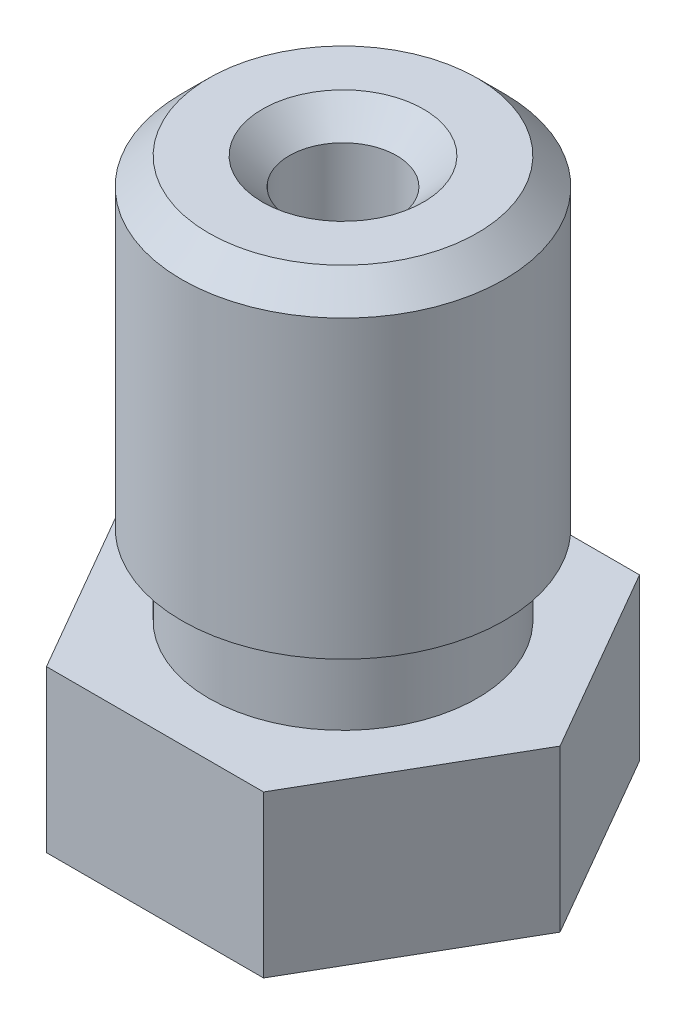
ISO-10303-21;
HEADER;
FILE_DESCRIPTION(('STEP AP214'),'2;1');
FILE_NAME('part.step','',(''),(''),'','','');
FILE_SCHEMA(('AUTOMOTIVE_DESIGN { 1 0 10303 214 1 1 1 1 }'));
ENDSEC;
DATA;
#1=APPLICATION_CONTEXT('core data for automotive mechanical design processes');
#2=APPLICATION_PROTOCOL_DEFINITION('international standard','automotive_design',2000,#1);
#3=PRODUCT_CONTEXT('',#1,'mechanical');
#4=PRODUCT('Part','Part','',(#3));
#5=PRODUCT_RELATED_PRODUCT_CATEGORY('part','',(#4));
#6=PRODUCT_DEFINITION_FORMATION('','',#4);
#7=PRODUCT_DEFINITION_CONTEXT('part definition',#1,'design');
#8=PRODUCT_DEFINITION('design','',#6,#7);
#9=PRODUCT_DEFINITION_SHAPE('','',#8);
#10=(LENGTH_UNIT() NAMED_UNIT(*) SI_UNIT(.MILLI.,.METRE.));
#11=(NAMED_UNIT(*) PLANE_ANGLE_UNIT() SI_UNIT($,.RADIAN.));
#12=(NAMED_UNIT(*) SI_UNIT($,.STERADIAN.) SOLID_ANGLE_UNIT());
#13=UNCERTAINTY_MEASURE_WITH_UNIT(LENGTH_MEASURE(1.E-05),#10,'distance_accuracy_value','');
#14=(GEOMETRIC_REPRESENTATION_CONTEXT(3) GLOBAL_UNCERTAINTY_ASSIGNED_CONTEXT((#13)) GLOBAL_UNIT_ASSIGNED_CONTEXT((#10,
#11,#12)) REPRESENTATION_CONTEXT('',''));
#15=CARTESIAN_POINT('',(0.,0.,0.));
#16=DIRECTION('',(0.,0.,1.));
#17=DIRECTION('',(1.,0.,0.));
#18=AXIS2_PLACEMENT_3D('',#15,#16,#17);
#19=CARTESIAN_POINT('',(2.02072594216369,3.,3.5));
#20=DIRECTION('',(0.,0.,1.));
#21=DIRECTION('',(1.,0.,0.));
#22=AXIS2_PLACEMENT_3D('',#19,#20,#21);
#23=PLANE('',#22);
#24=DIRECTION('',(-1.,0.,0.));
#25=VECTOR('',#24,1.);
#26=CARTESIAN_POINT('',(2.02072594216369,0.,3.5));
#27=LINE('',#26,#25);
#28=CARTESIAN_POINT('',(2.02072594216369,0.,3.5));
#29=VERTEX_POINT('',#28);
#30=CARTESIAN_POINT('',(-2.02072594216369,0.,3.5));
#31=VERTEX_POINT('',#30);
#32=EDGE_CURVE('E121',#29,#31,#27,.T.);
#33=ORIENTED_EDGE('',*,*,#32,.F.);
#34=DIRECTION('',(0.,-1.,0.));
#35=VECTOR('',#34,1.);
#36=CARTESIAN_POINT('',(2.02072594216369,3.,3.5));
#37=LINE('',#36,#35);
#38=CARTESIAN_POINT('',(2.02072594216369,3.,3.5));
#39=VERTEX_POINT('',#38);
#40=EDGE_CURVE('E50',#39,#29,#37,.T.);
#41=ORIENTED_EDGE('',*,*,#40,.F.);
#42=DIRECTION('',(-1.,0.,0.));
#43=VECTOR('',#42,1.);
#44=CARTESIAN_POINT('',(2.02072594216369,3.,3.5));
#45=LINE('',#44,#43);
#46=CARTESIAN_POINT('',(-2.02072594216369,3.,3.5));
#47=VERTEX_POINT('',#46);
#48=EDGE_CURVE('E137',#39,#47,#45,.T.);
#49=ORIENTED_EDGE('',*,*,#48,.T.);
#50=DIRECTION('',(0.,-1.,0.));
#51=VECTOR('',#50,1.);
#52=CARTESIAN_POINT('',(-2.02072594216369,3.,3.5));
#53=LINE('',#52,#51);
#54=EDGE_CURVE('E85',#47,#31,#53,.T.);
#55=ORIENTED_EDGE('',*,*,#54,.T.);
#56=EDGE_LOOP('',(#33,#41,#49,#55));
#57=FACE_BOUND('',#56,.T.);
#58=ADVANCED_FACE('F33',(#57),#23,.T.);
#59=CARTESIAN_POINT('',(4.04145188432738,3.,0.));
#60=DIRECTION('',(0.866025403784439,0.,0.5));
#61=DIRECTION('',(0.5,0.,-0.866025403784439));
#62=AXIS2_PLACEMENT_3D('',#59,#60,#61);
#63=PLANE('',#62);
#64=DIRECTION('',(-0.5,0.,0.866025403784439));
#65=VECTOR('',#64,1.);
#66=CARTESIAN_POINT('',(4.04145188432738,0.,0.));
#67=LINE('',#66,#65);
#68=CARTESIAN_POINT('',(4.04145188432738,0.,0.));
#69=VERTEX_POINT('',#68);
#70=EDGE_CURVE('E134',#69,#29,#67,.T.);
#71=ORIENTED_EDGE('',*,*,#70,.F.);
#72=DIRECTION('',(0.,-1.,0.));
#73=VECTOR('',#72,1.);
#74=CARTESIAN_POINT('',(4.04145188432738,3.,0.));
#75=LINE('',#74,#73);
#76=CARTESIAN_POINT('',(4.04145188432738,3.,0.));
#77=VERTEX_POINT('',#76);
#78=EDGE_CURVE('E73',#77,#69,#75,.T.);
#79=ORIENTED_EDGE('',*,*,#78,.F.);
#80=DIRECTION('',(-0.5,0.,0.866025403784439));
#81=VECTOR('',#80,1.);
#82=CARTESIAN_POINT('',(4.04145188432738,3.,0.));
#83=LINE('',#82,#81);
#84=EDGE_CURVE('E111',#77,#39,#83,.T.);
#85=ORIENTED_EDGE('',*,*,#84,.T.);
#86=ORIENTED_EDGE('',*,*,#40,.T.);
#87=EDGE_LOOP('',(#71,#79,#85,#86));
#88=FACE_BOUND('',#87,.T.);
#89=ADVANCED_FACE('F210',(#88),#63,.T.);
#90=CARTESIAN_POINT('',(2.02072594216369,3.,-3.5));
#91=DIRECTION('',(0.866025403784438,0.,-0.500000000000001));
#92=DIRECTION('',(-0.500000000000001,0.,-0.866025403784438));
#93=AXIS2_PLACEMENT_3D('',#90,#91,#92);
#94=PLANE('',#93);
#95=DIRECTION('',(0.500000000000001,0.,0.866025403784438));
#96=VECTOR('',#95,1.);
#97=CARTESIAN_POINT('',(2.02072594216369,0.,-3.5));
#98=LINE('',#97,#96);
#99=CARTESIAN_POINT('',(2.02072594216369,0.,-3.5));
#100=VERTEX_POINT('',#99);
#101=EDGE_CURVE('E98',#100,#69,#98,.T.);
#102=ORIENTED_EDGE('',*,*,#101,.F.);
#103=DIRECTION('',(0.,-1.,0.));
#104=VECTOR('',#103,1.);
#105=CARTESIAN_POINT('',(2.02072594216369,3.,-3.5));
#106=LINE('',#105,#104);
#107=CARTESIAN_POINT('',(2.02072594216369,3.,-3.5));
#108=VERTEX_POINT('',#107);
#109=EDGE_CURVE('E93',#108,#100,#106,.T.);
#110=ORIENTED_EDGE('',*,*,#109,.F.);
#111=DIRECTION('',(0.500000000000001,0.,0.866025403784438));
#112=VECTOR('',#111,1.);
#113=CARTESIAN_POINT('',(2.02072594216369,3.,-3.5));
#114=LINE('',#113,#112);
#115=EDGE_CURVE('E96',#108,#77,#114,.T.);
#116=ORIENTED_EDGE('',*,*,#115,.T.);
#117=ORIENTED_EDGE('',*,*,#78,.T.);
#118=EDGE_LOOP('',(#102,#110,#116,#117));
#119=FACE_BOUND('',#118,.T.);
#120=ADVANCED_FACE('F95',(#119),#94,.T.);
#121=CARTESIAN_POINT('',(-2.02072594216369,3.,-3.5));
#122=DIRECTION('',(0.,0.,-1.));
#123=DIRECTION('',(-1.,0.,0.));
#124=AXIS2_PLACEMENT_3D('',#121,#122,#123);
#125=PLANE('',#124);
#126=DIRECTION('',(1.,0.,0.));
#127=VECTOR('',#126,1.);
#128=CARTESIAN_POINT('',(-2.02072594216369,0.,-3.5));
#129=LINE('',#128,#127);
#130=CARTESIAN_POINT('',(-2.02072594216369,0.,-3.5));
#131=VERTEX_POINT('',#130);
#132=EDGE_CURVE('E131',#131,#100,#129,.T.);
#133=ORIENTED_EDGE('',*,*,#132,.F.);
#134=DIRECTION('',(0.,-1.,0.));
#135=VECTOR('',#134,1.);
#136=CARTESIAN_POINT('',(-2.02072594216369,3.,-3.5));
#137=LINE('',#136,#135);
#138=CARTESIAN_POINT('',(-2.02072594216369,3.,-3.5));
#139=VERTEX_POINT('',#138);
#140=EDGE_CURVE('E103',#139,#131,#137,.T.);
#141=ORIENTED_EDGE('',*,*,#140,.F.);
#142=DIRECTION('',(1.,0.,0.));
#143=VECTOR('',#142,1.);
#144=CARTESIAN_POINT('',(-2.02072594216369,3.,-3.5));
#145=LINE('',#144,#143);
#146=EDGE_CURVE('E109',#139,#108,#145,.T.);
#147=ORIENTED_EDGE('',*,*,#146,.T.);
#148=ORIENTED_EDGE('',*,*,#109,.T.);
#149=EDGE_LOOP('',(#133,#141,#147,#148));
#150=FACE_BOUND('',#149,.T.);
#151=ADVANCED_FACE('F113',(#150),#125,.T.);
#152=CARTESIAN_POINT('',(-4.04145188432738,3.,0.));
#153=DIRECTION('',(-0.866025403784439,0.,-0.5));
#154=DIRECTION('',(-0.5,0.,0.866025403784439));
#155=AXIS2_PLACEMENT_3D('',#152,#153,#154);
#156=PLANE('',#155);
#157=DIRECTION('',(0.5,0.,-0.866025403784439));
#158=VECTOR('',#157,1.);
#159=CARTESIAN_POINT('',(-4.04145188432738,0.,0.));
#160=LINE('',#159,#158);
#161=CARTESIAN_POINT('',(-4.04145188432738,0.,0.));
#162=VERTEX_POINT('',#161);
#163=EDGE_CURVE('E128',#162,#131,#160,.T.);
#164=ORIENTED_EDGE('',*,*,#163,.F.);
#165=DIRECTION('',(0.,-1.,0.));
#166=VECTOR('',#165,1.);
#167=CARTESIAN_POINT('',(-4.04145188432738,3.,0.));
#168=LINE('',#167,#166);
#169=CARTESIAN_POINT('',(-4.04145188432738,3.,0.));
#170=VERTEX_POINT('',#169);
#171=EDGE_CURVE('E142',#170,#162,#168,.T.);
#172=ORIENTED_EDGE('',*,*,#171,.F.);
#173=DIRECTION('',(0.5,0.,-0.866025403784439));
#174=VECTOR('',#173,1.);
#175=CARTESIAN_POINT('',(-4.04145188432738,3.,0.));
#176=LINE('',#175,#174);
#177=EDGE_CURVE('E114',#170,#139,#176,.T.);
#178=ORIENTED_EDGE('',*,*,#177,.T.);
#179=ORIENTED_EDGE('',*,*,#140,.T.);
#180=EDGE_LOOP('',(#164,#172,#178,#179));
#181=FACE_BOUND('',#180,.T.);
#182=ADVANCED_FACE('F224',(#181),#156,.T.);
#183=CARTESIAN_POINT('',(-2.02072594216369,3.,3.5));
#184=DIRECTION('',(-0.866025403784439,0.,0.5));
#185=DIRECTION('',(0.5,0.,0.866025403784439));
#186=AXIS2_PLACEMENT_3D('',#183,#184,#185);
#187=PLANE('',#186);
#188=DIRECTION('',(-0.5,0.,-0.866025403784439));
#189=VECTOR('',#188,1.);
#190=CARTESIAN_POINT('',(-2.02072594216369,0.,3.5));
#191=LINE('',#190,#189);
#192=EDGE_CURVE('E124',#31,#162,#191,.T.);
#193=ORIENTED_EDGE('',*,*,#192,.F.);
#194=ORIENTED_EDGE('',*,*,#54,.F.);
#195=DIRECTION('',(-0.5,0.,-0.866025403784439));
#196=VECTOR('',#195,1.);
#197=CARTESIAN_POINT('',(-2.02072594216369,3.,3.5));
#198=LINE('',#197,#196);
#199=EDGE_CURVE('E116',#47,#170,#198,.T.);
#200=ORIENTED_EDGE('',*,*,#199,.T.);
#201=ORIENTED_EDGE('',*,*,#171,.T.);
#202=EDGE_LOOP('',(#193,#194,#200,#201));
#203=FACE_BOUND('',#202,.T.);
#204=ADVANCED_FACE('F206',(#203),#187,.T.);
#205=CARTESIAN_POINT('',(0.,3.,0.));
#206=DIRECTION('',(0.,-1.,0.));
#207=DIRECTION('',(0.,0.,-1.));
#208=AXIS2_PLACEMENT_3D('',#205,#206,#207);
#209=PLANE('',#208);
#210=CARTESIAN_POINT('',(0.,3.,0.));
#211=DIRECTION('',(0.,1.,0.));
#212=DIRECTION('',(0.,0.,1.));
#213=AXIS2_PLACEMENT_3D('',#210,#211,#212);
#214=CIRCLE('',#213,2.5);
#215=CARTESIAN_POINT('',(0.,3.,2.5));
#216=VERTEX_POINT('',#215);
#217=EDGE_CURVE('E125',#216,#216,#214,.T.);
#218=ORIENTED_EDGE('',*,*,#217,.F.);
#219=EDGE_LOOP('',(#218));
#220=FACE_BOUND('',#219,.T.);
#221=ORIENTED_EDGE('',*,*,#48,.F.);
#222=ORIENTED_EDGE('',*,*,#84,.F.);
#223=ORIENTED_EDGE('',*,*,#115,.F.);
#224=ORIENTED_EDGE('',*,*,#146,.F.);
#225=ORIENTED_EDGE('',*,*,#177,.F.);
#226=ORIENTED_EDGE('',*,*,#199,.F.);
#227=EDGE_LOOP('',(#221,#222,#223,#224,#225,#226));
#228=FACE_BOUND('',#227,.T.);
#229=ADVANCED_FACE('F107',(#220,#228),#209,.F.);
#230=CARTESIAN_POINT('',(0.,0.,0.));
#231=DIRECTION('',(0.,-1.,0.));
#232=DIRECTION('',(0.,0.,-1.));
#233=AXIS2_PLACEMENT_3D('',#230,#231,#232);
#234=PLANE('',#233);
#235=CARTESIAN_POINT('',(0.,0.,0.));
#236=DIRECTION('',(0.,-1.,0.));
#237=DIRECTION('',(0.,0.,-1.));
#238=AXIS2_PLACEMENT_3D('',#235,#236,#237);
#239=CIRCLE('',#238,2.50000000004502);
#240=CARTESIAN_POINT('',(0.,0.,-2.50000000004502));
#241=VERTEX_POINT('',#240);
#242=EDGE_CURVE('E139',#241,#241,#239,.T.);
#243=ORIENTED_EDGE('',*,*,#242,.F.);
#244=EDGE_LOOP('',(#243));
#245=FACE_BOUND('',#244,.T.);
#246=ORIENTED_EDGE('',*,*,#32,.T.);
#247=ORIENTED_EDGE('',*,*,#192,.T.);
#248=ORIENTED_EDGE('',*,*,#163,.T.);
#249=ORIENTED_EDGE('',*,*,#132,.T.);
#250=ORIENTED_EDGE('',*,*,#101,.T.);
#251=ORIENTED_EDGE('',*,*,#70,.T.);
#252=EDGE_LOOP('',(#246,#247,#248,#249,#250,#251));
#253=FACE_BOUND('',#252,.T.);
#254=ADVANCED_FACE('F209',(#245,#253),#234,.T.);
#255=CARTESIAN_POINT('',(0.,3.,0.));
#256=DIRECTION('',(0.,1.,0.));
#257=DIRECTION('',(0.,0.,1.));
#258=AXIS2_PLACEMENT_3D('',#255,#256,#257);
#259=CYLINDRICAL_SURFACE('',#258,2.5);
#260=ORIENTED_EDGE('',*,*,#217,.T.);
#261=EDGE_LOOP('',(#260));
#262=FACE_BOUND('',#261,.T.);
#263=CARTESIAN_POINT('',(0.,4.5,0.));
#264=DIRECTION('',(0.,1.,0.));
#265=DIRECTION('',(0.,0.,1.));
#266=AXIS2_PLACEMENT_3D('',#263,#264,#265);
#267=CIRCLE('',#266,2.5);
#268=CARTESIAN_POINT('',(0.,4.5,2.5));
#269=VERTEX_POINT('',#268);
#270=EDGE_CURVE('E198',#269,#269,#267,.T.);
#271=ORIENTED_EDGE('',*,*,#270,.F.);
#272=EDGE_LOOP('',(#271));
#273=FACE_BOUND('',#272,.T.);
#274=ADVANCED_FACE('F167',(#262,#273),#259,.T.);
#275=CARTESIAN_POINT('',(0.,10.5,0.));
#276=DIRECTION('',(0.,1.,0.));
#277=DIRECTION('',(0.,0.,1.));
#278=AXIS2_PLACEMENT_3D('',#275,#276,#277);
#279=PLANE('',#278);
#280=CARTESIAN_POINT('',(0.,10.5,0.));
#281=DIRECTION('',(0.,1.,0.));
#282=DIRECTION('',(0.,0.,1.));
#283=AXIS2_PLACEMENT_3D('',#280,#281,#282);
#284=CIRCLE('',#283,2.4999999999834);
#285=CARTESIAN_POINT('',(0.,10.5,2.4999999999834));
#286=VERTEX_POINT('',#285);
#287=EDGE_CURVE('E150',#286,#286,#284,.T.);
#288=ORIENTED_EDGE('',*,*,#287,.T.);
#289=EDGE_LOOP('',(#288));
#290=FACE_BOUND('',#289,.T.);
#291=CARTESIAN_POINT('',(-1.10963134903613E-11,10.5,0.));
#292=DIRECTION('',(0.,1.,0.));
#293=DIRECTION('',(0.,0.,1.));
#294=AXIS2_PLACEMENT_3D('',#291,#292,#293);
#295=CIRCLE('',#294,1.5000000000277);
#296=CARTESIAN_POINT('',(-1.10963134903613E-11,10.5,1.5000000000277));
#297=VERTEX_POINT('',#296);
#298=EDGE_CURVE('E147',#297,#297,#295,.F.);
#299=ORIENTED_EDGE('',*,*,#298,.T.);
#300=EDGE_LOOP('',(#299));
#301=FACE_BOUND('',#300,.T.);
#302=ADVANCED_FACE('F164',(#290,#301),#279,.T.);
#303=CARTESIAN_POINT('',(0.,3.,0.));
#304=DIRECTION('',(0.,1.,0.));
#305=DIRECTION('',(0.,0.,1.));
#306=AXIS2_PLACEMENT_3D('',#303,#304,#305);
#307=CYLINDRICAL_SURFACE('',#306,3.);
#308=CARTESIAN_POINT('',(0.,9.9999999999834,0.));
#309=DIRECTION('',(0.,1.,0.));
#310=DIRECTION('',(0.,0.,1.));
#311=AXIS2_PLACEMENT_3D('',#308,#309,#310);
#312=CIRCLE('',#311,3.);
#313=CARTESIAN_POINT('',(0.,9.9999999999834,3.));
#314=VERTEX_POINT('',#313);
#315=EDGE_CURVE('E42',#314,#314,#312,.F.);
#316=ORIENTED_EDGE('',*,*,#315,.T.);
#317=EDGE_LOOP('',(#316));
#318=FACE_BOUND('',#317,.T.);
#319=CARTESIAN_POINT('',(0.,4.5,0.));
#320=DIRECTION('',(0.,1.,0.));
#321=DIRECTION('',(0.,0.,1.));
#322=AXIS2_PLACEMENT_3D('',#319,#320,#321);
#323=CIRCLE('',#322,3.);
#324=CARTESIAN_POINT('',(0.,4.5,3.));
#325=VERTEX_POINT('',#324);
#326=EDGE_CURVE('E201',#325,#325,#323,.T.);
#327=ORIENTED_EDGE('',*,*,#326,.T.);
#328=EDGE_LOOP('',(#327));
#329=FACE_BOUND('',#328,.T.);
#330=ADVANCED_FACE('F155',(#318,#329),#307,.T.);
#331=CARTESIAN_POINT('',(3.,4.5,0.));
#332=DIRECTION('',(0.,-1.,0.));
#333=DIRECTION('',(0.,0.,-1.));
#334=AXIS2_PLACEMENT_3D('',#331,#332,#333);
#335=PLANE('',#334);
#336=ORIENTED_EDGE('',*,*,#270,.T.);
#337=EDGE_LOOP('',(#336));
#338=FACE_BOUND('',#337,.T.);
#339=ORIENTED_EDGE('',*,*,#326,.F.);
#340=EDGE_LOOP('',(#339));
#341=FACE_BOUND('',#340,.T.);
#342=ADVANCED_FACE('F244',(#338,#341),#335,.T.);
#343=CARTESIAN_POINT('',(0.,-2.,0.));
#344=DIRECTION('',(0.,1.,0.));
#345=DIRECTION('',(-1.,0.,0.));
#346=AXIS2_PLACEMENT_3D('',#343,#344,#345);
#347=CONICAL_SURFACE('',#346,0.50000000004502,0.785398163397449);
#348=ORIENTED_EDGE('',*,*,#242,.T.);
#349=EDGE_LOOP('',(#348));
#350=FACE_BOUND('',#349,.T.);
#351=CARTESIAN_POINT('',(0.,-2.,0.));
#352=DIRECTION('',(0.,-1.,0.));
#353=DIRECTION('',(1.,0.,0.));
#354=AXIS2_PLACEMENT_3D('',#351,#352,#353);
#355=CIRCLE('',#354,0.50000000004502);
#356=CARTESIAN_POINT('',(0.50000000004502,-2.,0.));
#357=VERTEX_POINT('',#356);
#358=EDGE_CURVE('E189',#357,#357,#355,.T.);
#359=ORIENTED_EDGE('',*,*,#358,.F.);
#360=EDGE_LOOP('',(#359));
#361=FACE_BOUND('',#360,.T.);
#362=ADVANCED_FACE('F247',(#350,#361),#347,.T.);
#363=CARTESIAN_POINT('',(0.,-2.,0.));
#364=DIRECTION('',(0.,-1.,0.));
#365=DIRECTION('',(1.,0.,0.));
#366=AXIS2_PLACEMENT_3D('',#363,#364,#365);
#367=PLANE('',#366);
#368=CARTESIAN_POINT('',(-1.10963134903613E-11,-2.,0.));
#369=DIRECTION('',(0.,1.,0.));
#370=DIRECTION('',(0.,0.,1.));
#371=AXIS2_PLACEMENT_3D('',#368,#369,#370);
#372=CIRCLE('',#371,0.15);
#373=CARTESIAN_POINT('',(-1.10963134903613E-11,-2.,0.15));
#374=VERTEX_POINT('',#373);
#375=EDGE_CURVE('E185',#374,#374,#372,.T.);
#376=ORIENTED_EDGE('',*,*,#375,.T.);
#377=EDGE_LOOP('',(#376));
#378=FACE_BOUND('',#377,.T.);
#379=ORIENTED_EDGE('',*,*,#358,.T.);
#380=EDGE_LOOP('',(#379));
#381=FACE_BOUND('',#380,.T.);
#382=ADVANCED_FACE('F251',(#378,#381),#367,.T.);
#383=CARTESIAN_POINT('',(-1.10963134903613E-11,-2.,0.));
#384=DIRECTION('',(0.,1.,0.));
#385=DIRECTION('',(0.,0.,1.));
#386=AXIS2_PLACEMENT_3D('',#383,#384,#385);
#387=CYLINDRICAL_SURFACE('',#386,0.15);
#388=ORIENTED_EDGE('',*,*,#375,.F.);
#389=EDGE_LOOP('',(#388));
#390=FACE_BOUND('',#389,.T.);
#391=CARTESIAN_POINT('',(-1.10963134903613E-11,-1.20000000003984,0.));
#392=DIRECTION('',(0.,1.,0.));
#393=DIRECTION('',(0.,0.,1.));
#394=AXIS2_PLACEMENT_3D('',#391,#392,#393);
#395=CIRCLE('',#394,0.15);
#396=CARTESIAN_POINT('',(-1.10963134903613E-11,-1.20000000003984,0.15));
#397=VERTEX_POINT('',#396);
#398=EDGE_CURVE('E273',#397,#397,#395,.T.);
#399=ORIENTED_EDGE('',*,*,#398,.T.);
#400=EDGE_LOOP('',(#399));
#401=FACE_BOUND('',#400,.T.);
#402=ADVANCED_FACE('F179',(#390,#401),#387,.F.);
#403=CARTESIAN_POINT('',(-1.10963134903613E-11,-2.,0.));
#404=DIRECTION('',(0.,1.,0.));
#405=DIRECTION('',(0.,0.,1.));
#406=AXIS2_PLACEMENT_3D('',#403,#404,#405);
#407=CYLINDRICAL_SURFACE('',#406,1.0000000000111);
#408=CARTESIAN_POINT('',(-1.10963134903613E-11,9.9999999999834,0.));
#409=DIRECTION('',(0.,1.,0.));
#410=DIRECTION('',(0.,0.,1.));
#411=AXIS2_PLACEMENT_3D('',#408,#409,#410);
#412=CIRCLE('',#411,1.0000000000111);
#413=CARTESIAN_POINT('',(-1.10963134903613E-11,9.9999999999834,1.0000000000111));
#414=VERTEX_POINT('',#413);
#415=EDGE_CURVE('E11',#414,#414,#412,.T.);
#416=ORIENTED_EDGE('',*,*,#415,.T.);
#417=EDGE_LOOP('',(#416));
#418=FACE_BOUND('',#417,.T.);
#419=CARTESIAN_POINT('',(-1.10963134903613E-11,0.,0.));
#420=DIRECTION('',(0.,1.,0.));
#421=DIRECTION('',(0.,0.,1.));
#422=AXIS2_PLACEMENT_3D('',#419,#420,#421);
#423=CIRCLE('',#422,1.0000000000111);
#424=CARTESIAN_POINT('',(-1.10963134903613E-11,0.,1.0000000000111));
#425=VERTEX_POINT('',#424);
#426=EDGE_CURVE('E183',#425,#425,#423,.T.);
#427=ORIENTED_EDGE('',*,*,#426,.F.);
#428=EDGE_LOOP('',(#427));
#429=FACE_BOUND('',#428,.T.);
#430=ADVANCED_FACE('F175',(#418,#429),#407,.F.);
#431=CARTESIAN_POINT('',(-1.10963134903613E-11,0.,0.));
#432=DIRECTION('',(0.,1.,0.));
#433=DIRECTION('',(0.,0.,1.));
#434=AXIS2_PLACEMENT_3D('',#431,#432,#433);
#435=CONICAL_SURFACE('',#434,1.0000000000111,0.832981266710198);
#436=CARTESIAN_POINT('',(-1.10963134903613E-11,-0.227272727272521,0.));
#437=DIRECTION('',(0.,1.,0.));
#438=DIRECTION('',(0.,0.,1.));
#439=AXIS2_PLACEMENT_3D('',#436,#437,#438);
#440=CIRCLE('',#439,0.749999999993361);
#441=CARTESIAN_POINT('',(-1.10963134903613E-11,-0.227272727272521,0.749999999993361));
#442=VERTEX_POINT('',#441);
#443=EDGE_CURVE('E186',#442,#442,#440,.T.);
#444=ORIENTED_EDGE('',*,*,#443,.F.);
#445=EDGE_LOOP('',(#444));
#446=FACE_BOUND('',#445,.T.);
#447=ORIENTED_EDGE('',*,*,#426,.T.);
#448=EDGE_LOOP('',(#447));
#449=FACE_BOUND('',#448,.T.);
#450=ADVANCED_FACE('F178',(#446,#449),#435,.F.);
#451=CARTESIAN_POINT('',(-1.10963134903613E-11,-2.,0.));
#452=DIRECTION('',(0.,1.,0.));
#453=DIRECTION('',(0.,0.,1.));
#454=AXIS2_PLACEMENT_3D('',#451,#452,#453);
#455=CYLINDRICAL_SURFACE('',#454,0.749999999993361);
#456=CARTESIAN_POINT('',(-1.10963134903613E-11,-0.700000000000002,0.));
#457=DIRECTION('',(0.,1.,0.));
#458=DIRECTION('',(0.,0.,1.));
#459=AXIS2_PLACEMENT_3D('',#456,#457,#458);
#460=CIRCLE('',#459,0.749999999993361);
#461=CARTESIAN_POINT('',(-1.10963134903613E-11,-0.700000000000002,0.749999999993361));
#462=VERTEX_POINT('',#461);
#463=EDGE_CURVE('E192',#462,#462,#460,.T.);
#464=ORIENTED_EDGE('',*,*,#463,.F.);
#465=EDGE_LOOP('',(#464));
#466=FACE_BOUND('',#465,.T.);
#467=ORIENTED_EDGE('',*,*,#443,.T.);
#468=EDGE_LOOP('',(#467));
#469=FACE_BOUND('',#468,.T.);
#470=ADVANCED_FACE('F261',(#466,#469),#455,.F.);
#471=CARTESIAN_POINT('',(-1.10963134903613E-11,-0.700000000000002,0.));
#472=DIRECTION('',(0.,1.,0.));
#473=DIRECTION('',(0.,0.,1.));
#474=AXIS2_PLACEMENT_3D('',#471,#472,#473);
#475=CONICAL_SURFACE('',#474,0.749999999993361,0.876058050553571);
#476=ORIENTED_EDGE('',*,*,#398,.F.);
#477=EDGE_LOOP('',(#476));
#478=FACE_BOUND('',#477,.T.);
#479=ORIENTED_EDGE('',*,*,#463,.T.);
#480=EDGE_LOOP('',(#479));
#481=FACE_BOUND('',#480,.T.);
#482=ADVANCED_FACE('F161',(#478,#481),#475,.F.);
#483=CARTESIAN_POINT('',(0.,10.5,0.));
#484=DIRECTION('',(0.,-1.,0.));
#485=DIRECTION('',(0.,0.,-1.));
#486=AXIS2_PLACEMENT_3D('',#483,#484,#485);
#487=CONICAL_SURFACE('',#486,2.4999999999834,0.785398163397446);
#488=ORIENTED_EDGE('',*,*,#315,.F.);
#489=EDGE_LOOP('',(#488));
#490=FACE_BOUND('',#489,.T.);
#491=ORIENTED_EDGE('',*,*,#287,.F.);
#492=EDGE_LOOP('',(#491));
#493=FACE_BOUND('',#492,.T.);
#494=ADVANCED_FACE('F158',(#490,#493),#487,.T.);
#495=CARTESIAN_POINT('',(-1.10963134903613E-11,9.9999999999834,0.));
#496=DIRECTION('',(0.,1.,0.));
#497=DIRECTION('',(0.,0.,1.));
#498=AXIS2_PLACEMENT_3D('',#495,#496,#497);
#499=CONICAL_SURFACE('',#498,1.0000000000111,0.785398163397452);
#500=ORIENTED_EDGE('',*,*,#298,.F.);
#501=EDGE_LOOP('',(#500));
#502=FACE_BOUND('',#501,.T.);
#503=ORIENTED_EDGE('',*,*,#415,.F.);
#504=EDGE_LOOP('',(#503));
#505=FACE_BOUND('',#504,.T.);
#506=ADVANCED_FACE('F35',(#502,#505),#499,.F.);
#507=CLOSED_SHELL('',(#58,#89,#120,#151,#182,#204,#229,#254,#274,#302,#330,#342,#362,#382,#402,
#430,#450,#470,#482,#494,#506));
#508=MANIFOLD_SOLID_BREP('B2',#507);
#509=ADVANCED_BREP_SHAPE_REPRESENTATION('',(#18,#508),#14);
#510=SHAPE_DEFINITION_REPRESENTATION(#9,#509);
ENDSEC;
END-ISO-10303-21;
